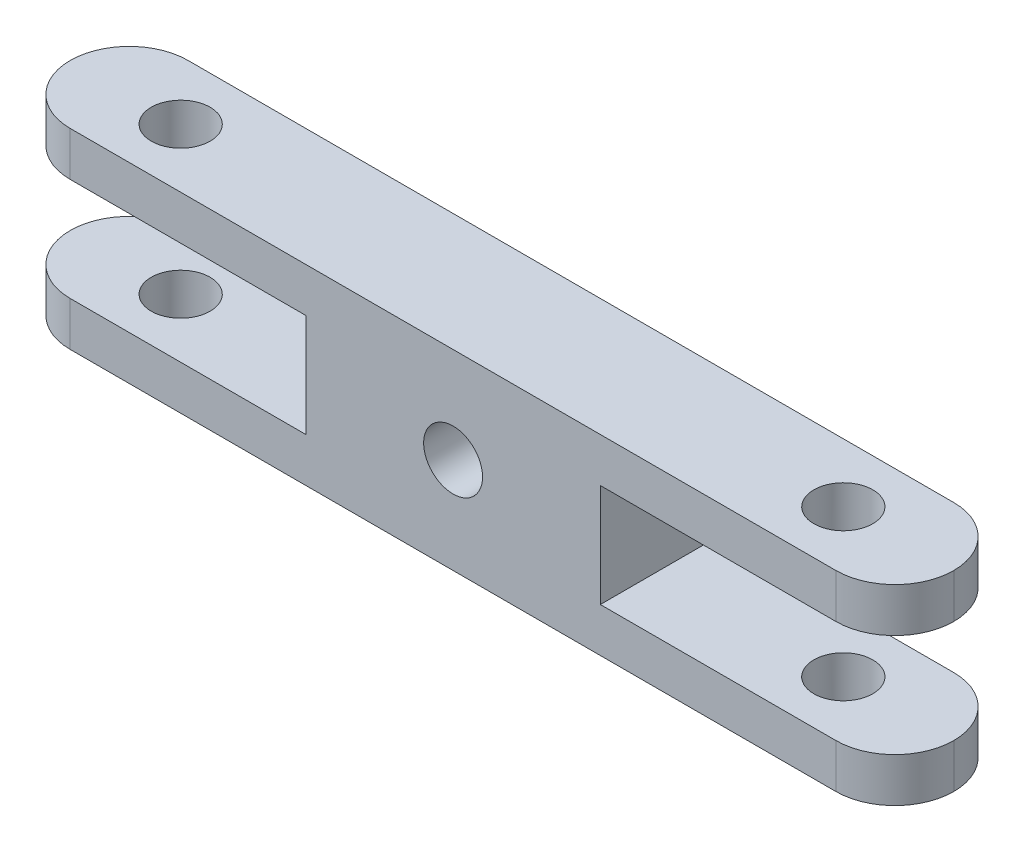
ISO-10303-21;
HEADER;
FILE_DESCRIPTION(('STEP AP214'),'2;1');
FILE_NAME('part.step','',(''),(''),'','','');
FILE_SCHEMA(('AUTOMOTIVE_DESIGN { 1 0 10303 214 1 1 1 1 }'));
ENDSEC;
DATA;
#1=APPLICATION_CONTEXT('core data for automotive mechanical design processes');
#2=APPLICATION_PROTOCOL_DEFINITION('international standard','automotive_design',2000,#1);
#3=PRODUCT_CONTEXT('',#1,'mechanical');
#4=PRODUCT('Part','Part','',(#3));
#5=PRODUCT_RELATED_PRODUCT_CATEGORY('part','',(#4));
#6=PRODUCT_DEFINITION_FORMATION('','',#4);
#7=PRODUCT_DEFINITION_CONTEXT('part definition',#1,'design');
#8=PRODUCT_DEFINITION('design','',#6,#7);
#9=PRODUCT_DEFINITION_SHAPE('','',#8);
#10=(LENGTH_UNIT() NAMED_UNIT(*) SI_UNIT(.MILLI.,.METRE.));
#11=(NAMED_UNIT(*) PLANE_ANGLE_UNIT() SI_UNIT($,.RADIAN.));
#12=(NAMED_UNIT(*) SI_UNIT($,.STERADIAN.) SOLID_ANGLE_UNIT());
#13=UNCERTAINTY_MEASURE_WITH_UNIT(LENGTH_MEASURE(1.E-05),#10,'distance_accuracy_value','');
#14=(GEOMETRIC_REPRESENTATION_CONTEXT(3) GLOBAL_UNCERTAINTY_ASSIGNED_CONTEXT((#13)) GLOBAL_UNIT_ASSIGNED_CONTEXT((#10,
#11,#12)) REPRESENTATION_CONTEXT('',''));
#15=CARTESIAN_POINT('',(0.,0.,0.));
#16=DIRECTION('',(0.,0.,1.));
#17=DIRECTION('',(1.,0.,0.));
#18=AXIS2_PLACEMENT_3D('',#15,#16,#17);
#19=CARTESIAN_POINT('',(-26.,0.,4.));
#20=DIRECTION('',(0.,1.,0.));
#21=DIRECTION('',(0.,0.,1.));
#22=AXIS2_PLACEMENT_3D('',#19,#20,#21);
#23=CYLINDRICAL_SURFACE('',#22,4.);
#24=CARTESIAN_POINT('',(-26.,3.5,4.));
#25=DIRECTION('',(0.,1.,0.));
#26=DIRECTION('',(0.,0.,1.));
#27=AXIS2_PLACEMENT_3D('',#24,#25,#26);
#28=CIRCLE('',#27,4.);
#29=CARTESIAN_POINT('',(-26.,3.5,8.));
#30=VERTEX_POINT('',#29);
#31=CARTESIAN_POINT('',(-30.,3.5,4.));
#32=VERTEX_POINT('',#31);
#33=EDGE_CURVE('E234',#30,#32,#28,.F.);
#34=ORIENTED_EDGE('',*,*,#33,.F.);
#35=DIRECTION('',(0.,-1.,0.));
#36=VECTOR('',#35,1.);
#37=CARTESIAN_POINT('',(-26.,-6.5,8.));
#38=LINE('',#37,#36);
#39=CARTESIAN_POINT('',(-26.,6.5,8.));
#40=VERTEX_POINT('',#39);
#41=EDGE_CURVE('E290',#40,#30,#38,.T.);
#42=ORIENTED_EDGE('',*,*,#41,.F.);
#43=CARTESIAN_POINT('',(-26.,6.5,4.));
#44=DIRECTION('',(0.,-1.,0.));
#45=DIRECTION('',(0.,0.,-1.));
#46=AXIS2_PLACEMENT_3D('',#43,#44,#45);
#47=CIRCLE('',#46,4.);
#48=CARTESIAN_POINT('',(-30.,6.5,4.));
#49=VERTEX_POINT('',#48);
#50=EDGE_CURVE('E276',#49,#40,#47,.F.);
#51=ORIENTED_EDGE('',*,*,#50,.F.);
#52=DIRECTION('',(0.,-1.,0.));
#53=VECTOR('',#52,1.);
#54=CARTESIAN_POINT('',(-30.,6.5,4.));
#55=LINE('',#54,#53);
#56=EDGE_CURVE('E303',#32,#49,#55,.F.);
#57=ORIENTED_EDGE('',*,*,#56,.F.);
#58=EDGE_LOOP('',(#34,#42,#51,#57));
#59=FACE_BOUND('',#58,.T.);
#60=ADVANCED_FACE('F43',(#59),#23,.T.);
#61=CARTESIAN_POINT('',(-26.,6.5,4.));
#62=DIRECTION('',(0.,-1.,0.));
#63=DIRECTION('',(0.,0.,-1.));
#64=AXIS2_PLACEMENT_3D('',#61,#62,#63);
#65=CYLINDRICAL_SURFACE('',#64,4.);
#66=CARTESIAN_POINT('',(-26.,3.5,4.));
#67=DIRECTION('',(0.,1.,0.));
#68=DIRECTION('',(0.,0.,1.));
#69=AXIS2_PLACEMENT_3D('',#66,#67,#68);
#70=CIRCLE('',#69,4.);
#71=CARTESIAN_POINT('',(-26.,3.5,0.));
#72=VERTEX_POINT('',#71);
#73=EDGE_CURVE('E11',#32,#72,#70,.F.);
#74=ORIENTED_EDGE('',*,*,#73,.F.);
#75=ORIENTED_EDGE('',*,*,#56,.T.);
#76=CARTESIAN_POINT('',(-26.,6.5,4.));
#77=DIRECTION('',(0.,-1.,0.));
#78=DIRECTION('',(0.,0.,-1.));
#79=AXIS2_PLACEMENT_3D('',#76,#77,#78);
#80=CIRCLE('',#79,4.);
#81=CARTESIAN_POINT('',(-26.,6.5,0.));
#82=VERTEX_POINT('',#81);
#83=EDGE_CURVE('E279',#82,#49,#80,.F.);
#84=ORIENTED_EDGE('',*,*,#83,.F.);
#85=DIRECTION('',(0.,-1.,0.));
#86=VECTOR('',#85,1.);
#87=CARTESIAN_POINT('',(-26.,0.,0.));
#88=LINE('',#87,#86);
#89=EDGE_CURVE('E271',#72,#82,#88,.F.);
#90=ORIENTED_EDGE('',*,*,#89,.F.);
#91=EDGE_LOOP('',(#74,#75,#84,#90));
#92=FACE_BOUND('',#91,.T.);
#93=ADVANCED_FACE('F371',(#92),#65,.T.);
#94=CARTESIAN_POINT('',(26.,0.,4.));
#95=DIRECTION('',(0.,-1.,0.));
#96=DIRECTION('',(0.,0.,-1.));
#97=AXIS2_PLACEMENT_3D('',#94,#95,#96);
#98=CYLINDRICAL_SURFACE('',#97,4.);
#99=CARTESIAN_POINT('',(26.,-3.5,4.));
#100=DIRECTION('',(0.,-1.,0.));
#101=DIRECTION('',(0.,0.,-1.));
#102=AXIS2_PLACEMENT_3D('',#99,#100,#101);
#103=CIRCLE('',#102,4.);
#104=CARTESIAN_POINT('',(26.,-3.5,8.));
#105=VERTEX_POINT('',#104);
#106=CARTESIAN_POINT('',(30.,-3.5,4.));
#107=VERTEX_POINT('',#106);
#108=EDGE_CURVE('E228',#105,#107,#103,.F.);
#109=ORIENTED_EDGE('',*,*,#108,.F.);
#110=DIRECTION('',(0.,1.,0.));
#111=VECTOR('',#110,1.);
#112=CARTESIAN_POINT('',(26.,6.5,8.));
#113=LINE('',#112,#111);
#114=CARTESIAN_POINT('',(26.,-6.5,8.));
#115=VERTEX_POINT('',#114);
#116=EDGE_CURVE('E295',#115,#105,#113,.T.);
#117=ORIENTED_EDGE('',*,*,#116,.F.);
#118=CARTESIAN_POINT('',(26.,-6.5,4.));
#119=DIRECTION('',(0.,1.,0.));
#120=DIRECTION('',(0.,0.,1.));
#121=AXIS2_PLACEMENT_3D('',#118,#119,#120);
#122=CIRCLE('',#121,4.);
#123=CARTESIAN_POINT('',(30.,-6.5,4.));
#124=VERTEX_POINT('',#123);
#125=EDGE_CURVE('E261',#124,#115,#122,.F.);
#126=ORIENTED_EDGE('',*,*,#125,.F.);
#127=DIRECTION('',(0.,1.,0.));
#128=VECTOR('',#127,1.);
#129=CARTESIAN_POINT('',(30.,-6.5,4.));
#130=LINE('',#129,#128);
#131=EDGE_CURVE('E237',#107,#124,#130,.F.);
#132=ORIENTED_EDGE('',*,*,#131,.F.);
#133=EDGE_LOOP('',(#109,#117,#126,#132));
#134=FACE_BOUND('',#133,.T.);
#135=ADVANCED_FACE('F378',(#134),#98,.T.);
#136=CARTESIAN_POINT('',(26.,6.5,4.));
#137=DIRECTION('',(0.,1.,0.));
#138=DIRECTION('',(0.,0.,1.));
#139=AXIS2_PLACEMENT_3D('',#136,#137,#138);
#140=CYLINDRICAL_SURFACE('',#139,4.);
#141=CARTESIAN_POINT('',(26.,-3.5,4.));
#142=DIRECTION('',(0.,-1.,0.));
#143=DIRECTION('',(0.,0.,-1.));
#144=AXIS2_PLACEMENT_3D('',#141,#142,#143);
#145=CIRCLE('',#144,4.);
#146=CARTESIAN_POINT('',(26.,-3.5,0.));
#147=VERTEX_POINT('',#146);
#148=EDGE_CURVE('E310',#107,#147,#145,.F.);
#149=ORIENTED_EDGE('',*,*,#148,.F.);
#150=ORIENTED_EDGE('',*,*,#131,.T.);
#151=CARTESIAN_POINT('',(26.,-6.5,4.));
#152=DIRECTION('',(0.,1.,0.));
#153=DIRECTION('',(0.,0.,1.));
#154=AXIS2_PLACEMENT_3D('',#151,#152,#153);
#155=CIRCLE('',#154,4.);
#156=CARTESIAN_POINT('',(26.,-6.5,0.));
#157=VERTEX_POINT('',#156);
#158=EDGE_CURVE('E264',#157,#124,#155,.F.);
#159=ORIENTED_EDGE('',*,*,#158,.F.);
#160=DIRECTION('',(0.,1.,0.));
#161=VECTOR('',#160,1.);
#162=CARTESIAN_POINT('',(26.,0.,0.));
#163=LINE('',#162,#161);
#164=EDGE_CURVE('E268',#147,#157,#163,.F.);
#165=ORIENTED_EDGE('',*,*,#164,.F.);
#166=EDGE_LOOP('',(#149,#150,#159,#165));
#167=FACE_BOUND('',#166,.T.);
#168=ADVANCED_FACE('F409',(#167),#140,.T.);
#169=CARTESIAN_POINT('',(-30.,6.5,8.));
#170=DIRECTION('',(0.,-1.,0.));
#171=DIRECTION('',(0.,0.,-1.));
#172=AXIS2_PLACEMENT_3D('',#169,#170,#171);
#173=PLANE('',#172);
#174=CARTESIAN_POINT('',(-22.5,6.5,4.));
#175=DIRECTION('',(0.,1.,0.));
#176=DIRECTION('',(0.,0.,1.));
#177=AXIS2_PLACEMENT_3D('',#174,#175,#176);
#178=CIRCLE('',#177,2.);
#179=CARTESIAN_POINT('',(-22.5,6.5,6.));
#180=VERTEX_POINT('',#179);
#181=EDGE_CURVE('E326',#180,#180,#178,.T.);
#182=ORIENTED_EDGE('',*,*,#181,.F.);
#183=EDGE_LOOP('',(#182));
#184=FACE_BOUND('',#183,.T.);
#185=CARTESIAN_POINT('',(22.5,6.5,4.));
#186=DIRECTION('',(0.,1.,0.));
#187=DIRECTION('',(0.,0.,1.));
#188=AXIS2_PLACEMENT_3D('',#185,#186,#187);
#189=CIRCLE('',#188,2.);
#190=CARTESIAN_POINT('',(22.5,6.5,6.));
#191=VERTEX_POINT('',#190);
#192=EDGE_CURVE('E332',#191,#191,#189,.T.);
#193=ORIENTED_EDGE('',*,*,#192,.F.);
#194=EDGE_LOOP('',(#193));
#195=FACE_BOUND('',#194,.T.);
#196=CARTESIAN_POINT('',(26.,6.5,4.));
#197=DIRECTION('',(0.,-1.,0.));
#198=DIRECTION('',(0.,0.,-1.));
#199=AXIS2_PLACEMENT_3D('',#196,#197,#198);
#200=CIRCLE('',#199,4.);
#201=CARTESIAN_POINT('',(26.,6.5,8.));
#202=VERTEX_POINT('',#201);
#203=CARTESIAN_POINT('',(30.,6.5,4.));
#204=VERTEX_POINT('',#203);
#205=EDGE_CURVE('E283',#202,#204,#200,.F.);
#206=ORIENTED_EDGE('',*,*,#205,.T.);
#207=CARTESIAN_POINT('',(26.,6.5,4.));
#208=DIRECTION('',(0.,-1.,0.));
#209=DIRECTION('',(0.,0.,-1.));
#210=AXIS2_PLACEMENT_3D('',#207,#208,#209);
#211=CIRCLE('',#210,4.);
#212=CARTESIAN_POINT('',(26.,6.5,0.));
#213=VERTEX_POINT('',#212);
#214=EDGE_CURVE('E286',#204,#213,#211,.F.);
#215=ORIENTED_EDGE('',*,*,#214,.T.);
#216=DIRECTION('',(-1.,0.,0.));
#217=VECTOR('',#216,1.);
#218=CARTESIAN_POINT('',(-30.,6.5,0.));
#219=LINE('',#218,#217);
#220=EDGE_CURVE('E248',#213,#82,#219,.T.);
#221=ORIENTED_EDGE('',*,*,#220,.T.);
#222=ORIENTED_EDGE('',*,*,#83,.T.);
#223=ORIENTED_EDGE('',*,*,#50,.T.);
#224=DIRECTION('',(-1.,0.,0.));
#225=VECTOR('',#224,1.);
#226=CARTESIAN_POINT('',(-30.,6.5,8.));
#227=LINE('',#226,#225);
#228=EDGE_CURVE('E238',#202,#40,#227,.T.);
#229=ORIENTED_EDGE('',*,*,#228,.F.);
#230=EDGE_LOOP('',(#206,#215,#221,#222,#223,#229));
#231=FACE_BOUND('',#230,.T.);
#232=ADVANCED_FACE('F429',(#184,#195,#231),#173,.F.);
#233=CARTESIAN_POINT('',(-30.,-6.5,8.));
#234=DIRECTION('',(0.,1.,0.));
#235=DIRECTION('',(0.,0.,1.));
#236=AXIS2_PLACEMENT_3D('',#233,#234,#235);
#237=PLANE('',#236);
#238=CARTESIAN_POINT('',(-22.5,-6.5,4.));
#239=DIRECTION('',(0.,1.,0.));
#240=DIRECTION('',(0.,0.,1.));
#241=AXIS2_PLACEMENT_3D('',#238,#239,#240);
#242=CIRCLE('',#241,2.);
#243=CARTESIAN_POINT('',(-22.5,-6.5,6.));
#244=VERTEX_POINT('',#243);
#245=EDGE_CURVE('E318',#244,#244,#242,.T.);
#246=ORIENTED_EDGE('',*,*,#245,.T.);
#247=EDGE_LOOP('',(#246));
#248=FACE_BOUND('',#247,.T.);
#249=CARTESIAN_POINT('',(22.5,-6.5,4.));
#250=DIRECTION('',(0.,1.,0.));
#251=DIRECTION('',(0.,0.,1.));
#252=AXIS2_PLACEMENT_3D('',#249,#250,#251);
#253=CIRCLE('',#252,2.);
#254=CARTESIAN_POINT('',(22.5,-6.5,6.));
#255=VERTEX_POINT('',#254);
#256=EDGE_CURVE('E341',#255,#255,#253,.T.);
#257=ORIENTED_EDGE('',*,*,#256,.T.);
#258=EDGE_LOOP('',(#257));
#259=FACE_BOUND('',#258,.T.);
#260=DIRECTION('',(1.,0.,0.));
#261=VECTOR('',#260,1.);
#262=CARTESIAN_POINT('',(-30.,-6.5,0.));
#263=LINE('',#262,#261);
#264=CARTESIAN_POINT('',(-26.,-6.5,0.));
#265=VERTEX_POINT('',#264);
#266=EDGE_CURVE('E243',#265,#157,#263,.T.);
#267=ORIENTED_EDGE('',*,*,#266,.T.);
#268=ORIENTED_EDGE('',*,*,#158,.T.);
#269=ORIENTED_EDGE('',*,*,#125,.T.);
#270=DIRECTION('',(1.,0.,0.));
#271=VECTOR('',#270,1.);
#272=CARTESIAN_POINT('',(-30.,-6.5,8.));
#273=LINE('',#272,#271);
#274=CARTESIAN_POINT('',(-26.,-6.5,8.));
#275=VERTEX_POINT('',#274);
#276=EDGE_CURVE('E242',#275,#115,#273,.T.);
#277=ORIENTED_EDGE('',*,*,#276,.F.);
#278=CARTESIAN_POINT('',(-26.,-6.5,4.));
#279=DIRECTION('',(0.,1.,0.));
#280=DIRECTION('',(0.,0.,1.));
#281=AXIS2_PLACEMENT_3D('',#278,#279,#280);
#282=CIRCLE('',#281,4.);
#283=CARTESIAN_POINT('',(-30.,-6.5,4.));
#284=VERTEX_POINT('',#283);
#285=EDGE_CURVE('E247',#275,#284,#282,.F.);
#286=ORIENTED_EDGE('',*,*,#285,.T.);
#287=CARTESIAN_POINT('',(-26.,-6.5,4.));
#288=DIRECTION('',(0.,1.,0.));
#289=DIRECTION('',(0.,0.,1.));
#290=AXIS2_PLACEMENT_3D('',#287,#288,#289);
#291=CIRCLE('',#290,4.);
#292=EDGE_CURVE('E258',#284,#265,#291,.F.);
#293=ORIENTED_EDGE('',*,*,#292,.T.);
#294=EDGE_LOOP('',(#267,#268,#269,#277,#286,#293));
#295=FACE_BOUND('',#294,.T.);
#296=ADVANCED_FACE('F402',(#248,#259,#295),#237,.F.);
#297=CARTESIAN_POINT('',(0.,0.,8.));
#298=DIRECTION('',(0.,0.,1.));
#299=DIRECTION('',(1.,0.,0.));
#300=AXIS2_PLACEMENT_3D('',#297,#298,#299);
#301=PLANE('',#300);
#302=CARTESIAN_POINT('',(0.,0.,8.));
#303=DIRECTION('',(0.,0.,1.));
#304=DIRECTION('',(1.,0.,0.));
#305=AXIS2_PLACEMENT_3D('',#302,#303,#304);
#306=CIRCLE('',#305,2.);
#307=CARTESIAN_POINT('',(2.,0.,8.));
#308=VERTEX_POINT('',#307);
#309=EDGE_CURVE('E335',#308,#308,#306,.T.);
#310=ORIENTED_EDGE('',*,*,#309,.F.);
#311=EDGE_LOOP('',(#310));
#312=FACE_BOUND('',#311,.T.);
#313=DIRECTION('',(1.,0.,0.));
#314=VECTOR('',#313,1.);
#315=CARTESIAN_POINT('',(9.99999999999999,-3.5,8.));
#316=LINE('',#315,#314);
#317=CARTESIAN_POINT('',(9.99999999999999,-3.5,8.));
#318=VERTEX_POINT('',#317);
#319=EDGE_CURVE('E188',#318,#105,#316,.T.);
#320=ORIENTED_EDGE('',*,*,#319,.F.);
#321=DIRECTION('',(0.,-1.,0.));
#322=VECTOR('',#321,1.);
#323=CARTESIAN_POINT('',(9.99999999999999,-3.5,8.));
#324=LINE('',#323,#322);
#325=CARTESIAN_POINT('',(9.99999999999999,3.5,8.));
#326=VERTEX_POINT('',#325);
#327=EDGE_CURVE('E184',#326,#318,#324,.T.);
#328=ORIENTED_EDGE('',*,*,#327,.F.);
#329=DIRECTION('',(-1.,0.,0.));
#330=VECTOR('',#329,1.);
#331=CARTESIAN_POINT('',(9.99999999999999,3.5,8.));
#332=LINE('',#331,#330);
#333=CARTESIAN_POINT('',(26.,3.5,8.));
#334=VERTEX_POINT('',#333);
#335=EDGE_CURVE('E160',#334,#326,#332,.T.);
#336=ORIENTED_EDGE('',*,*,#335,.F.);
#337=EDGE_CURVE('E294',#334,#202,#113,.T.);
#338=ORIENTED_EDGE('',*,*,#337,.T.);
#339=ORIENTED_EDGE('',*,*,#228,.T.);
#340=ORIENTED_EDGE('',*,*,#41,.T.);
#341=DIRECTION('',(-1.,0.,0.));
#342=VECTOR('',#341,1.);
#343=CARTESIAN_POINT('',(-30.,3.5,8.));
#344=LINE('',#343,#342);
#345=CARTESIAN_POINT('',(-9.99999999999999,3.5,8.));
#346=VERTEX_POINT('',#345);
#347=EDGE_CURVE('E208',#346,#30,#344,.T.);
#348=ORIENTED_EDGE('',*,*,#347,.F.);
#349=DIRECTION('',(0.,1.,0.));
#350=VECTOR('',#349,1.);
#351=CARTESIAN_POINT('',(-9.99999999999999,3.5,8.));
#352=LINE('',#351,#350);
#353=CARTESIAN_POINT('',(-9.99999999999999,-3.5,8.));
#354=VERTEX_POINT('',#353);
#355=EDGE_CURVE('E211',#354,#346,#352,.T.);
#356=ORIENTED_EDGE('',*,*,#355,.F.);
#357=DIRECTION('',(1.,0.,0.));
#358=VECTOR('',#357,1.);
#359=CARTESIAN_POINT('',(-30.,-3.5,8.));
#360=LINE('',#359,#358);
#361=CARTESIAN_POINT('',(-26.,-3.5,8.));
#362=VERTEX_POINT('',#361);
#363=EDGE_CURVE('E191',#362,#354,#360,.T.);
#364=ORIENTED_EDGE('',*,*,#363,.F.);
#365=EDGE_CURVE('E289',#362,#275,#38,.T.);
#366=ORIENTED_EDGE('',*,*,#365,.T.);
#367=ORIENTED_EDGE('',*,*,#276,.T.);
#368=ORIENTED_EDGE('',*,*,#116,.T.);
#369=EDGE_LOOP('',(#320,#328,#336,#338,#339,#340,#348,#356,#364,#366,#367,#368));
#370=FACE_BOUND('',#369,.T.);
#371=ADVANCED_FACE('F390',(#312,#370),#301,.T.);
#372=CARTESIAN_POINT('',(0.,0.,0.));
#373=DIRECTION('',(0.,0.,1.));
#374=DIRECTION('',(1.,0.,0.));
#375=AXIS2_PLACEMENT_3D('',#372,#373,#374);
#376=PLANE('',#375);
#377=CARTESIAN_POINT('',(0.,0.,0.));
#378=DIRECTION('',(0.,0.,1.));
#379=DIRECTION('',(1.,0.,0.));
#380=AXIS2_PLACEMENT_3D('',#377,#378,#379);
#381=CIRCLE('',#380,2.);
#382=CARTESIAN_POINT('',(2.,0.,0.));
#383=VERTEX_POINT('',#382);
#384=EDGE_CURVE('E344',#383,#383,#381,.T.);
#385=ORIENTED_EDGE('',*,*,#384,.T.);
#386=EDGE_LOOP('',(#385));
#387=FACE_BOUND('',#386,.T.);
#388=DIRECTION('',(0.,-1.,0.));
#389=VECTOR('',#388,1.);
#390=CARTESIAN_POINT('',(9.99999999999999,-3.5,0.));
#391=LINE('',#390,#389);
#392=CARTESIAN_POINT('',(9.99999999999999,3.5,0.));
#393=VERTEX_POINT('',#392);
#394=CARTESIAN_POINT('',(9.99999999999999,-3.5,0.));
#395=VERTEX_POINT('',#394);
#396=EDGE_CURVE('E166',#393,#395,#391,.T.);
#397=ORIENTED_EDGE('',*,*,#396,.T.);
#398=DIRECTION('',(1.,0.,0.));
#399=VECTOR('',#398,1.);
#400=CARTESIAN_POINT('',(9.99999999999999,-3.5,0.));
#401=LINE('',#400,#399);
#402=EDGE_CURVE('E181',#395,#147,#401,.T.);
#403=ORIENTED_EDGE('',*,*,#402,.T.);
#404=ORIENTED_EDGE('',*,*,#164,.T.);
#405=ORIENTED_EDGE('',*,*,#266,.F.);
#406=CARTESIAN_POINT('',(-26.,-3.5,0.));
#407=VERTEX_POINT('',#406);
#408=EDGE_CURVE('E272',#265,#407,#88,.F.);
#409=ORIENTED_EDGE('',*,*,#408,.T.);
#410=DIRECTION('',(1.,0.,0.));
#411=VECTOR('',#410,1.);
#412=CARTESIAN_POINT('',(-30.,-3.5,0.));
#413=LINE('',#412,#411);
#414=CARTESIAN_POINT('',(-9.99999999999999,-3.5,0.));
#415=VERTEX_POINT('',#414);
#416=EDGE_CURVE('E61',#407,#415,#413,.T.);
#417=ORIENTED_EDGE('',*,*,#416,.T.);
#418=DIRECTION('',(0.,1.,0.));
#419=VECTOR('',#418,1.);
#420=CARTESIAN_POINT('',(-9.99999999999999,3.5,0.));
#421=LINE('',#420,#419);
#422=CARTESIAN_POINT('',(-9.99999999999999,3.5,0.));
#423=VERTEX_POINT('',#422);
#424=EDGE_CURVE('E220',#415,#423,#421,.T.);
#425=ORIENTED_EDGE('',*,*,#424,.T.);
#426=DIRECTION('',(-1.,0.,0.));
#427=VECTOR('',#426,1.);
#428=CARTESIAN_POINT('',(-30.,3.5,0.));
#429=LINE('',#428,#427);
#430=EDGE_CURVE('E203',#423,#72,#429,.T.);
#431=ORIENTED_EDGE('',*,*,#430,.T.);
#432=ORIENTED_EDGE('',*,*,#89,.T.);
#433=ORIENTED_EDGE('',*,*,#220,.F.);
#434=CARTESIAN_POINT('',(26.,3.5,0.));
#435=VERTEX_POINT('',#434);
#436=EDGE_CURVE('E179',#213,#435,#163,.F.);
#437=ORIENTED_EDGE('',*,*,#436,.T.);
#438=DIRECTION('',(-1.,0.,0.));
#439=VECTOR('',#438,1.);
#440=CARTESIAN_POINT('',(9.99999999999999,3.5,0.));
#441=LINE('',#440,#439);
#442=EDGE_CURVE('E69',#435,#393,#441,.T.);
#443=ORIENTED_EDGE('',*,*,#442,.T.);
#444=EDGE_LOOP('',(#397,#403,#404,#405,#409,#417,#425,#431,#432,#433,#437,#443));
#445=FACE_BOUND('',#444,.T.);
#446=ADVANCED_FACE('F176',(#387,#445),#376,.F.);
#447=CARTESIAN_POINT('',(-26.,-3.5,4.));
#448=DIRECTION('',(0.,-1.,0.));
#449=DIRECTION('',(1.,0.,0.));
#450=AXIS2_PLACEMENT_3D('',#447,#448,#449);
#451=CIRCLE('',#450,4.);
#452=CARTESIAN_POINT('',(-30.,-3.5,4.));
#453=VERTEX_POINT('',#452);
#454=EDGE_CURVE('E231',#453,#362,#451,.F.);
#455=ORIENTED_EDGE('',*,*,#454,.F.);
#456=EDGE_CURVE('E252',#284,#453,#55,.F.);
#457=ORIENTED_EDGE('',*,*,#456,.F.);
#458=ORIENTED_EDGE('',*,*,#285,.F.);
#459=ORIENTED_EDGE('',*,*,#365,.F.);
#460=EDGE_LOOP('',(#455,#457,#458,#459));
#461=FACE_BOUND('',#460,.T.);
#462=ADVANCED_FACE('F374',(#461),#23,.T.);
#463=CARTESIAN_POINT('',(-26.,-3.5,4.));
#464=DIRECTION('',(0.,-1.,0.));
#465=DIRECTION('',(1.,0.,0.));
#466=AXIS2_PLACEMENT_3D('',#463,#464,#465);
#467=CIRCLE('',#466,4.);
#468=EDGE_CURVE('E53',#407,#453,#467,.F.);
#469=ORIENTED_EDGE('',*,*,#468,.F.);
#470=ORIENTED_EDGE('',*,*,#408,.F.);
#471=ORIENTED_EDGE('',*,*,#292,.F.);
#472=ORIENTED_EDGE('',*,*,#456,.T.);
#473=EDGE_LOOP('',(#469,#470,#471,#472));
#474=FACE_BOUND('',#473,.T.);
#475=ADVANCED_FACE('F381',(#474),#65,.T.);
#476=CARTESIAN_POINT('',(26.,3.5,4.));
#477=DIRECTION('',(0.,1.,0.));
#478=DIRECTION('',(-1.,0.,0.));
#479=AXIS2_PLACEMENT_3D('',#476,#477,#478);
#480=CIRCLE('',#479,4.);
#481=CARTESIAN_POINT('',(30.,3.5,4.));
#482=VERTEX_POINT('',#481);
#483=EDGE_CURVE('E197',#482,#334,#480,.F.);
#484=ORIENTED_EDGE('',*,*,#483,.F.);
#485=EDGE_CURVE('E304',#204,#482,#130,.F.);
#486=ORIENTED_EDGE('',*,*,#485,.F.);
#487=ORIENTED_EDGE('',*,*,#205,.F.);
#488=ORIENTED_EDGE('',*,*,#337,.F.);
#489=EDGE_LOOP('',(#484,#486,#487,#488));
#490=FACE_BOUND('',#489,.T.);
#491=ADVANCED_FACE('F45',(#490),#98,.T.);
#492=CARTESIAN_POINT('',(26.,3.5,4.));
#493=DIRECTION('',(0.,1.,0.));
#494=DIRECTION('',(-1.,0.,0.));
#495=AXIS2_PLACEMENT_3D('',#492,#493,#494);
#496=CIRCLE('',#495,4.);
#497=EDGE_CURVE('E299',#435,#482,#496,.F.);
#498=ORIENTED_EDGE('',*,*,#497,.F.);
#499=ORIENTED_EDGE('',*,*,#436,.F.);
#500=ORIENTED_EDGE('',*,*,#214,.F.);
#501=ORIENTED_EDGE('',*,*,#485,.T.);
#502=EDGE_LOOP('',(#498,#499,#500,#501));
#503=FACE_BOUND('',#502,.T.);
#504=ADVANCED_FACE('F440',(#503),#140,.T.);
#505=CARTESIAN_POINT('',(9.99999999999999,-3.5,0.));
#506=DIRECTION('',(0.,-1.,0.));
#507=DIRECTION('',(0.,0.,-1.));
#508=AXIS2_PLACEMENT_3D('',#505,#506,#507);
#509=PLANE('',#508);
#510=CARTESIAN_POINT('',(22.5,-3.5,4.));
#511=DIRECTION('',(0.,-1.,0.));
#512=DIRECTION('',(0.,0.,-1.));
#513=AXIS2_PLACEMENT_3D('',#510,#511,#512);
#514=CIRCLE('',#513,2.);
#515=CARTESIAN_POINT('',(22.5,-3.5,2.));
#516=VERTEX_POINT('',#515);
#517=EDGE_CURVE('E207',#516,#516,#514,.T.);
#518=ORIENTED_EDGE('',*,*,#517,.T.);
#519=EDGE_LOOP('',(#518));
#520=FACE_BOUND('',#519,.T.);
#521=ORIENTED_EDGE('',*,*,#108,.T.);
#522=ORIENTED_EDGE('',*,*,#148,.T.);
#523=ORIENTED_EDGE('',*,*,#402,.F.);
#524=DIRECTION('',(0.,0.,1.));
#525=VECTOR('',#524,1.);
#526=CARTESIAN_POINT('',(9.99999999999999,-3.5,0.));
#527=LINE('',#526,#525);
#528=EDGE_CURVE('E165',#395,#318,#527,.T.);
#529=ORIENTED_EDGE('',*,*,#528,.T.);
#530=ORIENTED_EDGE('',*,*,#319,.T.);
#531=EDGE_LOOP('',(#521,#522,#523,#529,#530));
#532=FACE_BOUND('',#531,.T.);
#533=ADVANCED_FACE('F457',(#520,#532),#509,.F.);
#534=CARTESIAN_POINT('',(9.99999999999999,-3.5,0.));
#535=DIRECTION('',(-1.,0.,0.));
#536=DIRECTION('',(0.,0.,1.));
#537=AXIS2_PLACEMENT_3D('',#534,#535,#536);
#538=PLANE('',#537);
#539=ORIENTED_EDGE('',*,*,#327,.T.);
#540=ORIENTED_EDGE('',*,*,#528,.F.);
#541=ORIENTED_EDGE('',*,*,#396,.F.);
#542=DIRECTION('',(0.,0.,1.));
#543=VECTOR('',#542,1.);
#544=CARTESIAN_POINT('',(9.99999999999999,3.5,0.));
#545=LINE('',#544,#543);
#546=EDGE_CURVE('E156',#393,#326,#545,.T.);
#547=ORIENTED_EDGE('',*,*,#546,.T.);
#548=EDGE_LOOP('',(#539,#540,#541,#547));
#549=FACE_BOUND('',#548,.T.);
#550=ADVANCED_FACE('F169',(#549),#538,.F.);
#551=CARTESIAN_POINT('',(9.99999999999999,3.5,0.));
#552=DIRECTION('',(0.,1.,0.));
#553=DIRECTION('',(-1.,0.,0.));
#554=AXIS2_PLACEMENT_3D('',#551,#552,#553);
#555=PLANE('',#554);
#556=CARTESIAN_POINT('',(22.5,3.5,4.));
#557=DIRECTION('',(0.,1.,0.));
#558=DIRECTION('',(-1.,0.,0.));
#559=AXIS2_PLACEMENT_3D('',#556,#557,#558);
#560=CIRCLE('',#559,2.);
#561=CARTESIAN_POINT('',(20.5,3.5,4.));
#562=VERTEX_POINT('',#561);
#563=EDGE_CURVE('E47',#562,#562,#560,.T.);
#564=ORIENTED_EDGE('',*,*,#563,.T.);
#565=EDGE_LOOP('',(#564));
#566=FACE_BOUND('',#565,.T.);
#567=ORIENTED_EDGE('',*,*,#483,.T.);
#568=ORIENTED_EDGE('',*,*,#335,.T.);
#569=ORIENTED_EDGE('',*,*,#546,.F.);
#570=ORIENTED_EDGE('',*,*,#442,.F.);
#571=ORIENTED_EDGE('',*,*,#497,.T.);
#572=EDGE_LOOP('',(#567,#568,#569,#570,#571));
#573=FACE_BOUND('',#572,.T.);
#574=ADVANCED_FACE('F158',(#566,#573),#555,.F.);
#575=CARTESIAN_POINT('',(-30.,3.5,0.));
#576=DIRECTION('',(0.,1.,0.));
#577=DIRECTION('',(0.,0.,1.));
#578=AXIS2_PLACEMENT_3D('',#575,#576,#577);
#579=PLANE('',#578);
#580=CARTESIAN_POINT('',(-22.5,3.5,4.));
#581=DIRECTION('',(0.,1.,0.));
#582=DIRECTION('',(0.,0.,1.));
#583=AXIS2_PLACEMENT_3D('',#580,#581,#582);
#584=CIRCLE('',#583,2.);
#585=CARTESIAN_POINT('',(-22.5,3.5,6.));
#586=VERTEX_POINT('',#585);
#587=EDGE_CURVE('E317',#586,#586,#584,.T.);
#588=ORIENTED_EDGE('',*,*,#587,.T.);
#589=EDGE_LOOP('',(#588));
#590=FACE_BOUND('',#589,.T.);
#591=ORIENTED_EDGE('',*,*,#33,.T.);
#592=ORIENTED_EDGE('',*,*,#73,.T.);
#593=ORIENTED_EDGE('',*,*,#430,.F.);
#594=DIRECTION('',(0.,0.,1.));
#595=VECTOR('',#594,1.);
#596=CARTESIAN_POINT('',(-9.99999999999999,3.5,0.));
#597=LINE('',#596,#595);
#598=EDGE_CURVE('E204',#423,#346,#597,.T.);
#599=ORIENTED_EDGE('',*,*,#598,.T.);
#600=ORIENTED_EDGE('',*,*,#347,.T.);
#601=EDGE_LOOP('',(#591,#592,#593,#599,#600));
#602=FACE_BOUND('',#601,.T.);
#603=ADVANCED_FACE('F444',(#590,#602),#579,.F.);
#604=CARTESIAN_POINT('',(-9.99999999999999,3.5,0.));
#605=DIRECTION('',(1.,0.,0.));
#606=DIRECTION('',(0.,0.,-1.));
#607=AXIS2_PLACEMENT_3D('',#604,#605,#606);
#608=PLANE('',#607);
#609=ORIENTED_EDGE('',*,*,#355,.T.);
#610=ORIENTED_EDGE('',*,*,#598,.F.);
#611=ORIENTED_EDGE('',*,*,#424,.F.);
#612=DIRECTION('',(0.,0.,1.));
#613=VECTOR('',#612,1.);
#614=CARTESIAN_POINT('',(-9.99999999999999,-3.5,0.));
#615=LINE('',#614,#613);
#616=EDGE_CURVE('E199',#415,#354,#615,.T.);
#617=ORIENTED_EDGE('',*,*,#616,.T.);
#618=EDGE_LOOP('',(#609,#610,#611,#617));
#619=FACE_BOUND('',#618,.T.);
#620=ADVANCED_FACE('F446',(#619),#608,.F.);
#621=CARTESIAN_POINT('',(-30.,-3.5,0.));
#622=DIRECTION('',(0.,-1.,0.));
#623=DIRECTION('',(1.,0.,0.));
#624=AXIS2_PLACEMENT_3D('',#621,#622,#623);
#625=PLANE('',#624);
#626=CARTESIAN_POINT('',(-22.5,-3.5,4.));
#627=DIRECTION('',(0.,-1.,0.));
#628=DIRECTION('',(1.,0.,0.));
#629=AXIS2_PLACEMENT_3D('',#626,#627,#628);
#630=CIRCLE('',#629,2.);
#631=CARTESIAN_POINT('',(-20.5,-3.5,4.));
#632=VERTEX_POINT('',#631);
#633=EDGE_CURVE('E314',#632,#632,#630,.T.);
#634=ORIENTED_EDGE('',*,*,#633,.T.);
#635=EDGE_LOOP('',(#634));
#636=FACE_BOUND('',#635,.T.);
#637=ORIENTED_EDGE('',*,*,#454,.T.);
#638=ORIENTED_EDGE('',*,*,#363,.T.);
#639=ORIENTED_EDGE('',*,*,#616,.F.);
#640=ORIENTED_EDGE('',*,*,#416,.F.);
#641=ORIENTED_EDGE('',*,*,#468,.T.);
#642=EDGE_LOOP('',(#637,#638,#639,#640,#641));
#643=FACE_BOUND('',#642,.T.);
#644=ADVANCED_FACE('F447',(#636,#643),#625,.F.);
#645=CARTESIAN_POINT('',(-22.5,-6.5,4.));
#646=DIRECTION('',(0.,1.,0.));
#647=DIRECTION('',(0.,0.,1.));
#648=AXIS2_PLACEMENT_3D('',#645,#646,#647);
#649=CYLINDRICAL_SURFACE('',#648,2.);
#650=ORIENTED_EDGE('',*,*,#245,.F.);
#651=EDGE_LOOP('',(#650));
#652=FACE_BOUND('',#651,.T.);
#653=ORIENTED_EDGE('',*,*,#633,.F.);
#654=EDGE_LOOP('',(#653));
#655=FACE_BOUND('',#654,.T.);
#656=ADVANCED_FACE('F366',(#652,#655),#649,.F.);
#657=ORIENTED_EDGE('',*,*,#181,.T.);
#658=EDGE_LOOP('',(#657));
#659=FACE_BOUND('',#658,.T.);
#660=ORIENTED_EDGE('',*,*,#587,.F.);
#661=EDGE_LOOP('',(#660));
#662=FACE_BOUND('',#661,.T.);
#663=ADVANCED_FACE('F357',(#659,#662),#649,.F.);
#664=CARTESIAN_POINT('',(22.5,-6.5,4.));
#665=DIRECTION('',(0.,1.,0.));
#666=DIRECTION('',(0.,0.,1.));
#667=AXIS2_PLACEMENT_3D('',#664,#665,#666);
#668=CYLINDRICAL_SURFACE('',#667,2.);
#669=ORIENTED_EDGE('',*,*,#192,.T.);
#670=EDGE_LOOP('',(#669));
#671=FACE_BOUND('',#670,.T.);
#672=ORIENTED_EDGE('',*,*,#563,.F.);
#673=EDGE_LOOP('',(#672));
#674=FACE_BOUND('',#673,.T.);
#675=ADVANCED_FACE('F354',(#671,#674),#668,.F.);
#676=ORIENTED_EDGE('',*,*,#256,.F.);
#677=EDGE_LOOP('',(#676));
#678=FACE_BOUND('',#677,.T.);
#679=ORIENTED_EDGE('',*,*,#517,.F.);
#680=EDGE_LOOP('',(#679));
#681=FACE_BOUND('',#680,.T.);
#682=ADVANCED_FACE('F356',(#678,#681),#668,.F.);
#683=CARTESIAN_POINT('',(0.,0.,0.));
#684=DIRECTION('',(0.,0.,1.));
#685=DIRECTION('',(1.,0.,0.));
#686=AXIS2_PLACEMENT_3D('',#683,#684,#685);
#687=CYLINDRICAL_SURFACE('',#686,2.);
#688=ORIENTED_EDGE('',*,*,#384,.F.);
#689=EDGE_LOOP('',(#688));
#690=FACE_BOUND('',#689,.T.);
#691=ORIENTED_EDGE('',*,*,#309,.T.);
#692=EDGE_LOOP('',(#691));
#693=FACE_BOUND('',#692,.T.);
#694=ADVANCED_FACE('F364',(#690,#693),#687,.F.);
#695=CLOSED_SHELL('',(#60,#93,#135,#168,#232,#296,#371,#446,#462,#475,#491,#504,#533,#550,#574,
#603,#620,#644,#656,#663,#675,#682,#694));
#696=MANIFOLD_SOLID_BREP('B2',#695);
#697=ADVANCED_BREP_SHAPE_REPRESENTATION('',(#18,#696),#14);
#698=SHAPE_DEFINITION_REPRESENTATION(#9,#697);
ENDSEC;
END-ISO-10303-21;
